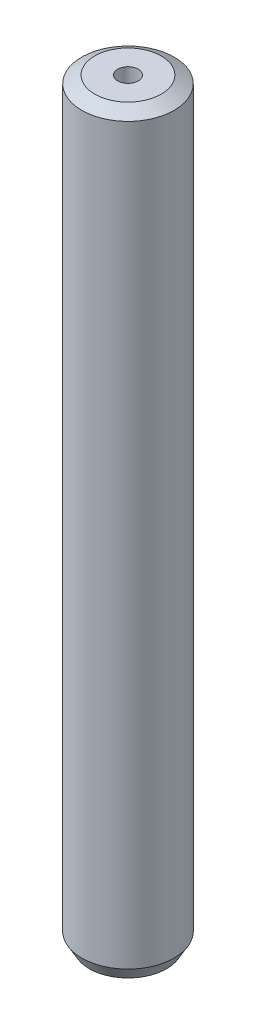
ISO-10303-21;
HEADER;
FILE_DESCRIPTION(('STEP AP214'),'2;1');
FILE_NAME('part.step','',(''),(''),'','','');
FILE_SCHEMA(('AUTOMOTIVE_DESIGN { 1 0 10303 214 1 1 1 1 }'));
ENDSEC;
DATA;
#1=APPLICATION_CONTEXT('core data for automotive mechanical design processes');
#2=APPLICATION_PROTOCOL_DEFINITION('international standard','automotive_design',2000,#1);
#3=PRODUCT_CONTEXT('',#1,'mechanical');
#4=PRODUCT('Part','Part','',(#3));
#5=PRODUCT_RELATED_PRODUCT_CATEGORY('part','',(#4));
#6=PRODUCT_DEFINITION_FORMATION('','',#4);
#7=PRODUCT_DEFINITION_CONTEXT('part definition',#1,'design');
#8=PRODUCT_DEFINITION('design','',#6,#7);
#9=PRODUCT_DEFINITION_SHAPE('','',#8);
#10=(LENGTH_UNIT() NAMED_UNIT(*) SI_UNIT(.MILLI.,.METRE.));
#11=(NAMED_UNIT(*) PLANE_ANGLE_UNIT() SI_UNIT($,.RADIAN.));
#12=(NAMED_UNIT(*) SI_UNIT($,.STERADIAN.) SOLID_ANGLE_UNIT());
#13=UNCERTAINTY_MEASURE_WITH_UNIT(LENGTH_MEASURE(1.E-05),#10,'distance_accuracy_value','');
#14=(GEOMETRIC_REPRESENTATION_CONTEXT(3) GLOBAL_UNCERTAINTY_ASSIGNED_CONTEXT((#13)) GLOBAL_UNIT_ASSIGNED_CONTEXT((#10,
#11,#12)) REPRESENTATION_CONTEXT('',''));
#15=CARTESIAN_POINT('',(0.,0.,0.));
#16=DIRECTION('',(0.,0.,1.));
#17=DIRECTION('',(1.,0.,0.));
#18=AXIS2_PLACEMENT_3D('',#15,#16,#17);
#19=CARTESIAN_POINT('',(0.,122.534306762355,0.));
#20=DIRECTION('',(0.,-1.,0.));
#21=DIRECTION('',(0.,0.,-1.));
#22=AXIS2_PLACEMENT_3D('',#19,#20,#21);
#23=CYLINDRICAL_SURFACE('',#22,7.5);
#24=CARTESIAN_POINT('',(0.,121.314925358673,0.));
#25=DIRECTION('',(0.,1.,0.));
#26=DIRECTION('',(0.,0.,1.));
#27=AXIS2_PLACEMENT_3D('',#24,#25,#26);
#28=CIRCLE('',#27,7.5);
#29=CARTESIAN_POINT('',(0.,121.314925358673,7.5));
#30=VERTEX_POINT('',#29);
#31=EDGE_CURVE('E50',#30,#30,#28,.F.);
#32=ORIENTED_EDGE('',*,*,#31,.T.);
#33=EDGE_LOOP('',(#32));
#34=FACE_BOUND('',#33,.T.);
#35=CARTESIAN_POINT('',(0.,2.11203054498219,0.));
#36=DIRECTION('',(0.,1.,0.));
#37=DIRECTION('',(0.,0.,1.));
#38=AXIS2_PLACEMENT_3D('',#35,#36,#37);
#39=CIRCLE('',#38,7.5);
#40=CARTESIAN_POINT('',(0.,2.11203054498219,7.5));
#41=VERTEX_POINT('',#40);
#42=EDGE_CURVE('E51',#41,#41,#39,.T.);
#43=ORIENTED_EDGE('',*,*,#42,.T.);
#44=EDGE_LOOP('',(#43));
#45=FACE_BOUND('',#44,.T.);
#46=ADVANCED_FACE('F39',(#34,#45),#23,.T.);
#47=CARTESIAN_POINT('',(0.,122.534306762355,0.));
#48=DIRECTION('',(0.,1.,0.));
#49=DIRECTION('',(0.,0.,1.));
#50=AXIS2_PLACEMENT_3D('',#47,#48,#49);
#51=PLANE('',#50);
#52=CARTESIAN_POINT('',(0.,122.534306762355,0.));
#53=DIRECTION('',(0.,1.,0.));
#54=DIRECTION('',(0.,0.,1.));
#55=AXIS2_PLACEMENT_3D('',#52,#53,#54);
#56=CIRCLE('',#55,5.38796945501774);
#57=CARTESIAN_POINT('',(0.,122.534306762355,5.38796945501774));
#58=VERTEX_POINT('',#57);
#59=EDGE_CURVE('E54',#58,#58,#56,.T.);
#60=ORIENTED_EDGE('',*,*,#59,.T.);
#61=EDGE_LOOP('',(#60));
#62=FACE_BOUND('',#61,.T.);
#63=CARTESIAN_POINT('',(0.,122.534306762355,0.));
#64=DIRECTION('',(0.,1.,0.));
#65=DIRECTION('',(0.,0.,1.));
#66=AXIS2_PLACEMENT_3D('',#63,#64,#65);
#67=CIRCLE('',#66,1.66170077398968);
#68=CARTESIAN_POINT('',(0.,122.534306762355,1.66170077398968));
#69=VERTEX_POINT('',#68);
#70=EDGE_CURVE('E58',#69,#69,#67,.T.);
#71=ORIENTED_EDGE('',*,*,#70,.F.);
#72=EDGE_LOOP('',(#71));
#73=FACE_BOUND('',#72,.T.);
#74=ADVANCED_FACE('F69',(#62,#73),#51,.T.);
#75=CARTESIAN_POINT('',(0.,0.,0.));
#76=DIRECTION('',(0.,1.,0.));
#77=DIRECTION('',(0.,0.,1.));
#78=AXIS2_PLACEMENT_3D('',#75,#76,#77);
#79=PLANE('',#78);
#80=CARTESIAN_POINT('',(0.,0.,0.));
#81=DIRECTION('',(0.,1.,0.));
#82=DIRECTION('',(0.,0.,1.));
#83=AXIS2_PLACEMENT_3D('',#80,#81,#82);
#84=CIRCLE('',#83,6.28061859631782);
#85=CARTESIAN_POINT('',(0.,0.,6.28061859631782));
#86=VERTEX_POINT('',#85);
#87=EDGE_CURVE('E10',#86,#86,#84,.F.);
#88=ORIENTED_EDGE('',*,*,#87,.T.);
#89=EDGE_LOOP('',(#88));
#90=FACE_BOUND('',#89,.T.);
#91=CARTESIAN_POINT('',(0.,0.,0.));
#92=DIRECTION('',(0.,1.,0.));
#93=DIRECTION('',(0.,0.,1.));
#94=AXIS2_PLACEMENT_3D('',#91,#92,#93);
#95=CIRCLE('',#94,1.66170077398968);
#96=CARTESIAN_POINT('',(0.,0.,1.66170077398968));
#97=VERTEX_POINT('',#96);
#98=EDGE_CURVE('E63',#97,#97,#95,.T.);
#99=ORIENTED_EDGE('',*,*,#98,.T.);
#100=EDGE_LOOP('',(#99));
#101=FACE_BOUND('',#100,.T.);
#102=ADVANCED_FACE('F75',(#90,#101),#79,.F.);
#103=CARTESIAN_POINT('',(0.,122.534306762355,0.));
#104=DIRECTION('',(0.,-1.,0.));
#105=DIRECTION('',(0.,0.,-1.));
#106=AXIS2_PLACEMENT_3D('',#103,#104,#105);
#107=CYLINDRICAL_SURFACE('',#106,1.66170077398968);
#108=ORIENTED_EDGE('',*,*,#70,.T.);
#109=EDGE_LOOP('',(#108));
#110=FACE_BOUND('',#109,.T.);
#111=ORIENTED_EDGE('',*,*,#98,.F.);
#112=EDGE_LOOP('',(#111));
#113=FACE_BOUND('',#112,.T.);
#114=ADVANCED_FACE('F70',(#110,#113),#107,.F.);
#115=CARTESIAN_POINT('',(0.,122.534306762355,0.));
#116=DIRECTION('',(0.,-1.,0.));
#117=DIRECTION('',(0.,0.,-1.));
#118=AXIS2_PLACEMENT_3D('',#115,#116,#117);
#119=CONICAL_SURFACE('',#118,5.38796945501774,1.0471975511966);
#120=ORIENTED_EDGE('',*,*,#31,.F.);
#121=EDGE_LOOP('',(#120));
#122=FACE_BOUND('',#121,.T.);
#123=ORIENTED_EDGE('',*,*,#59,.F.);
#124=EDGE_LOOP('',(#123));
#125=FACE_BOUND('',#124,.T.);
#126=ADVANCED_FACE('F81',(#122,#125),#119,.T.);
#127=CARTESIAN_POINT('',(0.,2.11203054498219,0.));
#128=DIRECTION('',(0.,1.,0.));
#129=DIRECTION('',(0.,0.,1.));
#130=AXIS2_PLACEMENT_3D('',#127,#128,#129);
#131=CONICAL_SURFACE('',#130,7.5,0.523598775598301);
#132=ORIENTED_EDGE('',*,*,#87,.F.);
#133=EDGE_LOOP('',(#132));
#134=FACE_BOUND('',#133,.T.);
#135=ORIENTED_EDGE('',*,*,#42,.F.);
#136=EDGE_LOOP('',(#135));
#137=FACE_BOUND('',#136,.T.);
#138=ADVANCED_FACE('F45',(#134,#137),#131,.T.);
#139=CLOSED_SHELL('',(#46,#74,#102,#114,#126,#138));
#140=MANIFOLD_SOLID_BREP('B2',#139);
#141=ADVANCED_BREP_SHAPE_REPRESENTATION('',(#18,#140),#14);
#142=SHAPE_DEFINITION_REPRESENTATION(#9,#141);
ENDSEC;
END-ISO-10303-21;
